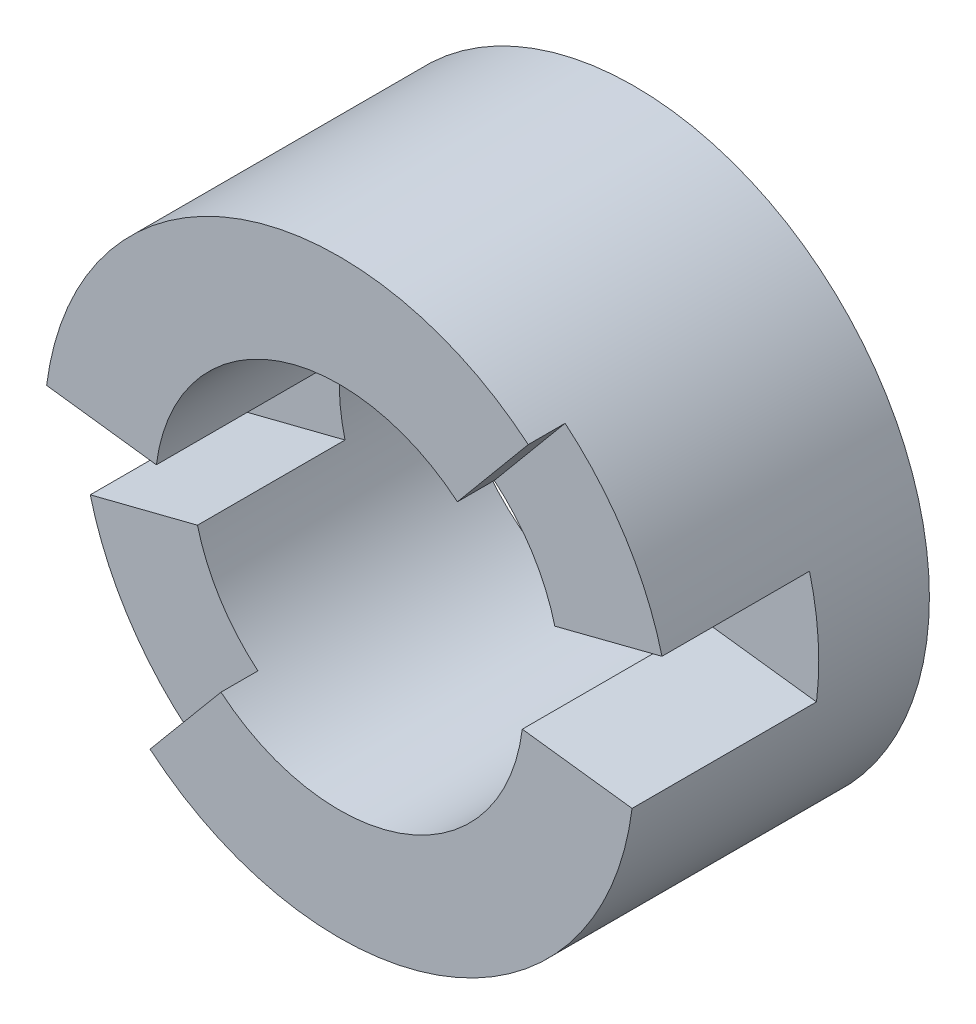
ISO-10303-21;
HEADER;
FILE_DESCRIPTION(('STEP AP214'),'2;1');
FILE_NAME('part.step','',(''),(''),'','','');
FILE_SCHEMA(('AUTOMOTIVE_DESIGN { 1 0 10303 214 1 1 1 1 }'));
ENDSEC;
DATA;
#1=APPLICATION_CONTEXT('core data for automotive mechanical design processes');
#2=APPLICATION_PROTOCOL_DEFINITION('international standard','automotive_design',2000,#1);
#3=PRODUCT_CONTEXT('',#1,'mechanical');
#4=PRODUCT('Part','Part','',(#3));
#5=PRODUCT_RELATED_PRODUCT_CATEGORY('part','',(#4));
#6=PRODUCT_DEFINITION_FORMATION('','',#4);
#7=PRODUCT_DEFINITION_CONTEXT('part definition',#1,'design');
#8=PRODUCT_DEFINITION('design','',#6,#7);
#9=PRODUCT_DEFINITION_SHAPE('','',#8);
#10=(LENGTH_UNIT() NAMED_UNIT(*) SI_UNIT(.MILLI.,.METRE.));
#11=(NAMED_UNIT(*) PLANE_ANGLE_UNIT() SI_UNIT($,.RADIAN.));
#12=(NAMED_UNIT(*) SI_UNIT($,.STERADIAN.) SOLID_ANGLE_UNIT());
#13=UNCERTAINTY_MEASURE_WITH_UNIT(LENGTH_MEASURE(1.E-05),#10,'distance_accuracy_value','');
#14=(GEOMETRIC_REPRESENTATION_CONTEXT(3) GLOBAL_UNCERTAINTY_ASSIGNED_CONTEXT((#13)) GLOBAL_UNIT_ASSIGNED_CONTEXT((#10,
#11,#12)) REPRESENTATION_CONTEXT('',''));
#15=CARTESIAN_POINT('',(0.,0.,0.));
#16=DIRECTION('',(0.,0.,1.));
#17=DIRECTION('',(1.,0.,0.));
#18=AXIS2_PLACEMENT_3D('',#15,#16,#17);
#19=CARTESIAN_POINT('',(0.,0.,8.));
#20=DIRECTION('',(0.,0.,1.));
#21=DIRECTION('',(1.,0.,0.));
#22=AXIS2_PLACEMENT_3D('',#19,#20,#21);
#23=PLANE('',#22);
#24=DIRECTION('',(-0.992098070814687,0.12546480735958,0.));
#25=VECTOR('',#24,1.);
#26=CARTESIAN_POINT('',(-7.93678456651749,1.00371845887664,8.));
#27=LINE('',#26,#25);
#28=CARTESIAN_POINT('',(-4.96049035407344,0.6273240367979,8.));
#29=VERTEX_POINT('',#28);
#30=CARTESIAN_POINT('',(-7.93678456651749,1.00371845887664,8.));
#31=VERTEX_POINT('',#30);
#32=EDGE_CURVE('E175',#29,#31,#27,.T.);
#33=ORIENTED_EDGE('',*,*,#32,.F.);
#34=CARTESIAN_POINT('',(0.,0.,8.));
#35=DIRECTION('',(0.,0.,1.));
#36=DIRECTION('',(1.,0.,0.));
#37=AXIS2_PLACEMENT_3D('',#34,#35,#36);
#38=CIRCLE('',#37,5.);
#39=CARTESIAN_POINT('',(3.20192719765573,3.84026850896035,8.));
#40=VERTEX_POINT('',#39);
#41=EDGE_CURVE('E211',#40,#29,#38,.T.);
#42=ORIENTED_EDGE('',*,*,#41,.F.);
#43=DIRECTION('',(0.640385439531147,0.768053701792069,0.));
#44=VECTOR('',#43,1.);
#45=CARTESIAN_POINT('',(5.12308351624917,6.14442961433655,8.));
#46=LINE('',#45,#44);
#47=CARTESIAN_POINT('',(5.12308351624917,6.14442961433655,8.));
#48=VERTEX_POINT('',#47);
#49=EDGE_CURVE('E110',#40,#48,#46,.T.);
#50=ORIENTED_EDGE('',*,*,#49,.T.);
#51=CARTESIAN_POINT('',(0.,0.,8.));
#52=DIRECTION('',(0.,0.,1.));
#53=DIRECTION('',(1.,0.,0.));
#54=AXIS2_PLACEMENT_3D('',#51,#52,#53);
#55=CIRCLE('',#54,8.);
#56=EDGE_CURVE('E193',#48,#31,#55,.T.);
#57=ORIENTED_EDGE('',*,*,#56,.T.);
#58=EDGE_LOOP('',(#33,#42,#50,#57));
#59=FACE_BOUND('',#58,.T.);
#60=ADVANCED_FACE('F87',(#59),#23,.T.);
#61=DIRECTION('',(-0.641607870316109,-0.767032815952765,0.));
#62=VECTOR('',#61,1.);
#63=CARTESIAN_POINT('',(-5.13286296252887,-6.13626252762211,8.));
#64=LINE('',#63,#62);
#65=CARTESIAN_POINT('',(-3.20803935158054,-3.83516407976382,8.));
#66=VERTEX_POINT('',#65);
#67=CARTESIAN_POINT('',(-5.13286296252887,-6.13626252762211,8.));
#68=VERTEX_POINT('',#67);
#69=EDGE_CURVE('E102',#66,#68,#64,.T.);
#70=ORIENTED_EDGE('',*,*,#69,.T.);
#71=CARTESIAN_POINT('',(7.93837307564306,-0.991076642800792,8.));
#72=VERTEX_POINT('',#71);
#73=EDGE_CURVE('E201',#68,#72,#55,.T.);
#74=ORIENTED_EDGE('',*,*,#73,.T.);
#75=DIRECTION('',(0.992296634455383,-0.123884580350099,0.));
#76=VECTOR('',#75,1.);
#77=CARTESIAN_POINT('',(7.93837307564306,-0.991076642800792,8.));
#78=LINE('',#77,#76);
#79=CARTESIAN_POINT('',(4.96148317227692,-0.619422901750495,8.));
#80=VERTEX_POINT('',#79);
#81=EDGE_CURVE('E242',#80,#72,#78,.T.);
#82=ORIENTED_EDGE('',*,*,#81,.F.);
#83=EDGE_CURVE('E237',#66,#80,#38,.T.);
#84=ORIENTED_EDGE('',*,*,#83,.F.);
#85=EDGE_LOOP('',(#70,#74,#82,#84));
#86=FACE_BOUND('',#85,.T.);
#87=ADVANCED_FACE('F320',(#86),#23,.T.);
#88=CARTESIAN_POINT('',(0.,0.,0.));
#89=DIRECTION('',(0.,0.,1.));
#90=DIRECTION('',(1.,0.,0.));
#91=AXIS2_PLACEMENT_3D('',#88,#89,#90);
#92=PLANE('',#91);
#93=CARTESIAN_POINT('',(0.,0.,0.));
#94=DIRECTION('',(0.,0.,1.));
#95=DIRECTION('',(1.,0.,0.));
#96=AXIS2_PLACEMENT_3D('',#93,#94,#95);
#97=CIRCLE('',#96,8.);
#98=CARTESIAN_POINT('',(8.,0.,0.));
#99=VERTEX_POINT('',#98);
#100=EDGE_CURVE('E205',#99,#99,#97,.T.);
#101=ORIENTED_EDGE('',*,*,#100,.F.);
#102=EDGE_LOOP('',(#101));
#103=FACE_BOUND('',#102,.T.);
#104=CARTESIAN_POINT('',(0.,0.,0.));
#105=DIRECTION('',(0.,0.,1.));
#106=DIRECTION('',(1.,0.,0.));
#107=AXIS2_PLACEMENT_3D('',#104,#105,#106);
#108=CIRCLE('',#107,5.);
#109=CARTESIAN_POINT('',(5.,0.,0.));
#110=VERTEX_POINT('',#109);
#111=EDGE_CURVE('E208',#110,#110,#108,.T.);
#112=ORIENTED_EDGE('',*,*,#111,.T.);
#113=EDGE_LOOP('',(#112));
#114=FACE_BOUND('',#113,.T.);
#115=ADVANCED_FACE('F353',(#103,#114),#92,.F.);
#116=CARTESIAN_POINT('',(0.,0.,8.));
#117=DIRECTION('',(0.,0.,-1.));
#118=DIRECTION('',(-1.,0.,0.));
#119=AXIS2_PLACEMENT_3D('',#116,#117,#118);
#120=CYLINDRICAL_SURFACE('',#119,8.);
#121=CARTESIAN_POINT('',(0.,0.,3.));
#122=DIRECTION('',(0.,0.,-1.));
#123=DIRECTION('',(-0.992098070814687,0.12546480735958,0.));
#124=AXIS2_PLACEMENT_3D('',#121,#122,#123);
#125=CIRCLE('',#124,8.);
#126=CARTESIAN_POINT('',(-7.75287303104365,-1.97305847975067,3.));
#127=VERTEX_POINT('',#126);
#128=CARTESIAN_POINT('',(-7.93678456651749,1.00371845887664,3.));
#129=VERTEX_POINT('',#128);
#130=EDGE_CURVE('E196',#127,#129,#125,.T.);
#131=ORIENTED_EDGE('',*,*,#130,.T.);
#132=DIRECTION('',(0.,0.,-1.));
#133=VECTOR('',#132,1.);
#134=CARTESIAN_POINT('',(-7.93678456651749,1.00371845887664,8.));
#135=LINE('',#134,#133);
#136=EDGE_CURVE('E179',#31,#129,#135,.T.);
#137=ORIENTED_EDGE('',*,*,#136,.F.);
#138=ORIENTED_EDGE('',*,*,#56,.F.);
#139=DIRECTION('',(0.,0.,1.));
#140=VECTOR('',#139,1.);
#141=CARTESIAN_POINT('',(5.12308351624918,6.14442961433655,7.));
#142=LINE('',#141,#140);
#143=CARTESIAN_POINT('',(5.12308351624917,6.14442961433655,7.));
#144=VERTEX_POINT('',#143);
#145=EDGE_CURVE('E186',#144,#48,#142,.T.);
#146=ORIENTED_EDGE('',*,*,#145,.F.);
#147=CARTESIAN_POINT('',(0.,0.,7.));
#148=DIRECTION('',(0.,0.,-1.));
#149=DIRECTION('',(0.968715100118265,0.248175451652373,0.));
#150=AXIS2_PLACEMENT_3D('',#147,#148,#149);
#151=CIRCLE('',#150,8.);
#152=CARTESIAN_POINT('',(7.74972080094612,1.98540361321898,7.));
#153=VERTEX_POINT('',#152);
#154=EDGE_CURVE('E241',#144,#153,#151,.T.);
#155=ORIENTED_EDGE('',*,*,#154,.T.);
#156=DIRECTION('',(0.,0.,1.));
#157=VECTOR('',#156,1.);
#158=CARTESIAN_POINT('',(7.74972080094612,1.98540361321898,3.));
#159=LINE('',#158,#157);
#160=CARTESIAN_POINT('',(7.74972080094612,1.98540361321899,3.));
#161=VERTEX_POINT('',#160);
#162=EDGE_CURVE('E258',#161,#153,#159,.T.);
#163=ORIENTED_EDGE('',*,*,#162,.F.);
#164=CARTESIAN_POINT('',(0.,0.,3.));
#165=DIRECTION('',(0.,0.,-1.));
#166=DIRECTION('',(0.992296634455383,-0.123884580350098,0.));
#167=AXIS2_PLACEMENT_3D('',#164,#165,#166);
#168=CIRCLE('',#167,8.);
#169=CARTESIAN_POINT('',(7.93837307564306,-0.991076642800787,3.));
#170=VERTEX_POINT('',#169);
#171=EDGE_CURVE('E262',#161,#170,#168,.T.);
#172=ORIENTED_EDGE('',*,*,#171,.T.);
#173=DIRECTION('',(0.,0.,-1.));
#174=VECTOR('',#173,1.);
#175=CARTESIAN_POINT('',(7.93837307564306,-0.991076642800787,7.99999999999999));
#176=LINE('',#175,#174);
#177=EDGE_CURVE('E254',#72,#170,#176,.T.);
#178=ORIENTED_EDGE('',*,*,#177,.F.);
#179=ORIENTED_EDGE('',*,*,#73,.F.);
#180=DIRECTION('',(0.,0.,1.));
#181=VECTOR('',#180,1.);
#182=CARTESIAN_POINT('',(-5.13286296252886,-6.13626252762212,7.00000000000003));
#183=LINE('',#182,#181);
#184=CARTESIAN_POINT('',(-5.13286296252886,-6.13626252762212,7.00000000000001));
#185=VERTEX_POINT('',#184);
#186=EDGE_CURVE('E198',#185,#68,#183,.T.);
#187=ORIENTED_EDGE('',*,*,#186,.F.);
#188=CARTESIAN_POINT('',(0.,0.,7.00000000000001));
#189=DIRECTION('',(0.,0.,-1.));
#190=DIRECTION('',(-0.969109128880456,-0.246632309968834,0.));
#191=AXIS2_PLACEMENT_3D('',#188,#189,#190);
#192=CIRCLE('',#191,8.);
#193=CARTESIAN_POINT('',(-7.75287303104365,-1.97305847975067,7.00000000000001));
#194=VERTEX_POINT('',#193);
#195=EDGE_CURVE('E270',#185,#194,#192,.T.);
#196=ORIENTED_EDGE('',*,*,#195,.T.);
#197=DIRECTION('',(0.,0.,1.));
#198=VECTOR('',#197,1.);
#199=CARTESIAN_POINT('',(-7.75287303104365,-1.97305847975067,3.));
#200=LINE('',#199,#198);
#201=EDGE_CURVE('E281',#127,#194,#200,.T.);
#202=ORIENTED_EDGE('',*,*,#201,.F.);
#203=EDGE_LOOP('',(#131,#137,#138,#146,#155,#163,#172,#178,#179,#187,#196,#202));
#204=FACE_BOUND('',#203,.T.);
#205=ORIENTED_EDGE('',*,*,#100,.T.);
#206=EDGE_LOOP('',(#205));
#207=FACE_BOUND('',#206,.T.);
#208=ADVANCED_FACE('F89',(#204,#207),#120,.T.);
#209=CARTESIAN_POINT('',(0.,0.,8.));
#210=DIRECTION('',(0.,0.,-1.));
#211=DIRECTION('',(-1.,0.,0.));
#212=AXIS2_PLACEMENT_3D('',#209,#210,#211);
#213=CYLINDRICAL_SURFACE('',#212,5.);
#214=DIRECTION('',(0.,0.,-1.));
#215=VECTOR('',#214,1.);
#216=CARTESIAN_POINT('',(-4.96049035407344,0.627324036797901,8.));
#217=LINE('',#216,#215);
#218=CARTESIAN_POINT('',(-4.96049035407344,0.627324036797901,3.));
#219=VERTEX_POINT('',#218);
#220=EDGE_CURVE('E13',#219,#29,#217,.F.);
#221=ORIENTED_EDGE('',*,*,#220,.F.);
#222=CARTESIAN_POINT('',(0.,0.,3.));
#223=DIRECTION('',(0.,0.,1.));
#224=DIRECTION('',(1.,0.,0.));
#225=AXIS2_PLACEMENT_3D('',#222,#223,#224);
#226=CIRCLE('',#225,5.);
#227=CARTESIAN_POINT('',(-4.84554564440228,-1.23316154984417,3.));
#228=VERTEX_POINT('',#227);
#229=EDGE_CURVE('E95',#228,#219,#226,.F.);
#230=ORIENTED_EDGE('',*,*,#229,.F.);
#231=DIRECTION('',(0.,0.,-1.));
#232=VECTOR('',#231,1.);
#233=CARTESIAN_POINT('',(-4.84554564440228,-1.23316154984417,8.));
#234=LINE('',#233,#232);
#235=CARTESIAN_POINT('',(-4.84554564440228,-1.23316154984417,7.00000000000001));
#236=VERTEX_POINT('',#235);
#237=EDGE_CURVE('E225',#236,#228,#234,.T.);
#238=ORIENTED_EDGE('',*,*,#237,.F.);
#239=CARTESIAN_POINT('',(0.,0.,7.00000000000001));
#240=DIRECTION('',(0.,0.,1.));
#241=DIRECTION('',(1.,0.,0.));
#242=AXIS2_PLACEMENT_3D('',#239,#240,#241);
#243=CIRCLE('',#242,5.);
#244=CARTESIAN_POINT('',(-3.20803935158054,-3.83516407976383,7.00000000000001));
#245=VERTEX_POINT('',#244);
#246=EDGE_CURVE('E223',#245,#236,#243,.F.);
#247=ORIENTED_EDGE('',*,*,#246,.F.);
#248=DIRECTION('',(0.,0.,-1.));
#249=VECTOR('',#248,1.);
#250=CARTESIAN_POINT('',(-3.20803935158054,-3.83516407976382,8.));
#251=LINE('',#250,#249);
#252=EDGE_CURVE('E221',#66,#245,#251,.T.);
#253=ORIENTED_EDGE('',*,*,#252,.F.);
#254=ORIENTED_EDGE('',*,*,#83,.T.);
#255=DIRECTION('',(0.,0.,-1.));
#256=VECTOR('',#255,1.);
#257=CARTESIAN_POINT('',(4.96148317227692,-0.619422901750492,8.));
#258=LINE('',#257,#256);
#259=CARTESIAN_POINT('',(4.96148317227692,-0.619422901750492,3.));
#260=VERTEX_POINT('',#259);
#261=EDGE_CURVE('E218',#260,#80,#258,.F.);
#262=ORIENTED_EDGE('',*,*,#261,.F.);
#263=CARTESIAN_POINT('',(0.,0.,3.));
#264=DIRECTION('',(0.,0.,1.));
#265=DIRECTION('',(1.,0.,0.));
#266=AXIS2_PLACEMENT_3D('',#263,#264,#265);
#267=CIRCLE('',#266,5.);
#268=CARTESIAN_POINT('',(4.84357550059133,1.24087725826187,3.));
#269=VERTEX_POINT('',#268);
#270=EDGE_CURVE('E216',#269,#260,#267,.F.);
#271=ORIENTED_EDGE('',*,*,#270,.F.);
#272=DIRECTION('',(0.,0.,-1.));
#273=VECTOR('',#272,1.);
#274=CARTESIAN_POINT('',(4.84357550059133,1.24087725826187,8.));
#275=LINE('',#274,#273);
#276=CARTESIAN_POINT('',(4.84357550059133,1.24087725826187,7.));
#277=VERTEX_POINT('',#276);
#278=EDGE_CURVE('E214',#277,#269,#275,.T.);
#279=ORIENTED_EDGE('',*,*,#278,.F.);
#280=CARTESIAN_POINT('',(0.,0.,7.));
#281=DIRECTION('',(0.,0.,1.));
#282=DIRECTION('',(1.,0.,0.));
#283=AXIS2_PLACEMENT_3D('',#280,#281,#282);
#284=CIRCLE('',#283,5.);
#285=CARTESIAN_POINT('',(3.20192719765573,3.84026850896034,7.));
#286=VERTEX_POINT('',#285);
#287=EDGE_CURVE('E203',#286,#277,#284,.F.);
#288=ORIENTED_EDGE('',*,*,#287,.F.);
#289=DIRECTION('',(0.,0.,-1.));
#290=VECTOR('',#289,1.);
#291=CARTESIAN_POINT('',(3.20192719765574,3.84026850896034,8.));
#292=LINE('',#291,#290);
#293=EDGE_CURVE('E200',#40,#286,#292,.T.);
#294=ORIENTED_EDGE('',*,*,#293,.F.);
#295=ORIENTED_EDGE('',*,*,#41,.T.);
#296=EDGE_LOOP('',(#221,#230,#238,#247,#253,#254,#262,#271,#279,#288,#294,#295));
#297=FACE_BOUND('',#296,.T.);
#298=ORIENTED_EDGE('',*,*,#111,.F.);
#299=EDGE_LOOP('',(#298));
#300=FACE_BOUND('',#299,.T.);
#301=ADVANCED_FACE('F234',(#297,#300),#213,.F.);
#302=CARTESIAN_POINT('',(7.93837307564306,-0.991076642800787,5.5));
#303=DIRECTION('',(-0.123884580350098,-0.992296634455383,0.));
#304=DIRECTION('',(0.,0.,-1.));
#305=AXIS2_PLACEMENT_3D('',#302,#303,#304);
#306=PLANE('',#305);
#307=ORIENTED_EDGE('',*,*,#261,.T.);
#308=ORIENTED_EDGE('',*,*,#81,.T.);
#309=ORIENTED_EDGE('',*,*,#177,.T.);
#310=DIRECTION('',(0.992296634455383,-0.123884580350098,0.));
#311=VECTOR('',#310,1.);
#312=CARTESIAN_POINT('',(7.93837307564306,-0.991076642800787,3.));
#313=LINE('',#312,#311);
#314=EDGE_CURVE('E245',#260,#170,#313,.T.);
#315=ORIENTED_EDGE('',*,*,#314,.F.);
#316=EDGE_LOOP('',(#307,#308,#309,#315));
#317=FACE_BOUND('',#316,.T.);
#318=ADVANCED_FACE('F323',(#317),#306,.F.);
#319=CARTESIAN_POINT('',(0.,0.,3.));
#320=DIRECTION('',(0.,0.,1.));
#321=DIRECTION('',(1.,0.,0.));
#322=AXIS2_PLACEMENT_3D('',#319,#320,#321);
#323=PLANE('',#322);
#324=ORIENTED_EDGE('',*,*,#270,.T.);
#325=ORIENTED_EDGE('',*,*,#314,.T.);
#326=ORIENTED_EDGE('',*,*,#171,.F.);
#327=DIRECTION('',(0.968715100118265,0.248175451652373,0.));
#328=VECTOR('',#327,1.);
#329=CARTESIAN_POINT('',(7.74972080094612,1.98540361321899,3.));
#330=LINE('',#329,#328);
#331=EDGE_CURVE('E247',#269,#161,#330,.T.);
#332=ORIENTED_EDGE('',*,*,#331,.F.);
#333=EDGE_LOOP('',(#324,#325,#326,#332));
#334=FACE_BOUND('',#333,.T.);
#335=ADVANCED_FACE('F329',(#334),#323,.T.);
#336=CARTESIAN_POINT('',(7.74972080094612,1.98540361321898,5.));
#337=DIRECTION('',(-0.248175451652373,0.968715100118265,0.));
#338=DIRECTION('',(0.,0.,1.));
#339=AXIS2_PLACEMENT_3D('',#336,#337,#338);
#340=PLANE('',#339);
#341=ORIENTED_EDGE('',*,*,#278,.T.);
#342=ORIENTED_EDGE('',*,*,#331,.T.);
#343=ORIENTED_EDGE('',*,*,#162,.T.);
#344=DIRECTION('',(0.968715100118265,0.248175451652373,0.));
#345=VECTOR('',#344,1.);
#346=CARTESIAN_POINT('',(7.74972080094612,1.98540361321898,7.));
#347=LINE('',#346,#345);
#348=EDGE_CURVE('E249',#277,#153,#347,.T.);
#349=ORIENTED_EDGE('',*,*,#348,.F.);
#350=EDGE_LOOP('',(#341,#342,#343,#349));
#351=FACE_BOUND('',#350,.T.);
#352=ADVANCED_FACE('F334',(#351),#340,.F.);
#353=CARTESIAN_POINT('',(0.,0.,7.));
#354=DIRECTION('',(0.,0.,1.));
#355=DIRECTION('',(1.,0.,0.));
#356=AXIS2_PLACEMENT_3D('',#353,#354,#355);
#357=PLANE('',#356);
#358=ORIENTED_EDGE('',*,*,#287,.T.);
#359=ORIENTED_EDGE('',*,*,#348,.T.);
#360=ORIENTED_EDGE('',*,*,#154,.F.);
#361=DIRECTION('',(0.640385439531147,0.768053701792069,0.));
#362=VECTOR('',#361,1.);
#363=CARTESIAN_POINT('',(5.12308351624917,6.14442961433655,7.));
#364=LINE('',#363,#362);
#365=EDGE_CURVE('E240',#286,#144,#364,.T.);
#366=ORIENTED_EDGE('',*,*,#365,.F.);
#367=EDGE_LOOP('',(#358,#359,#360,#366));
#368=FACE_BOUND('',#367,.T.);
#369=ADVANCED_FACE('F337',(#368),#357,.T.);
#370=CARTESIAN_POINT('',(5.12308351624918,6.14442961433655,7.5));
#371=DIRECTION('',(-0.768053701792069,0.640385439531147,0.));
#372=DIRECTION('',(0.,0.,1.));
#373=AXIS2_PLACEMENT_3D('',#370,#371,#372);
#374=PLANE('',#373);
#375=ORIENTED_EDGE('',*,*,#293,.T.);
#376=ORIENTED_EDGE('',*,*,#365,.T.);
#377=ORIENTED_EDGE('',*,*,#145,.T.);
#378=ORIENTED_EDGE('',*,*,#49,.F.);
#379=EDGE_LOOP('',(#375,#376,#377,#378));
#380=FACE_BOUND('',#379,.T.);
#381=ADVANCED_FACE('F339',(#380),#374,.F.);
#382=CARTESIAN_POINT('',(-7.93678456651749,1.00371845887664,5.5));
#383=DIRECTION('',(0.12546480735958,0.992098070814687,0.));
#384=DIRECTION('',(0.,0.,-1.));
#385=AXIS2_PLACEMENT_3D('',#382,#383,#384);
#386=PLANE('',#385);
#387=ORIENTED_EDGE('',*,*,#220,.T.);
#388=ORIENTED_EDGE('',*,*,#32,.T.);
#389=ORIENTED_EDGE('',*,*,#136,.T.);
#390=DIRECTION('',(-0.992098070814687,0.12546480735958,0.));
#391=VECTOR('',#390,1.);
#392=CARTESIAN_POINT('',(-7.93678456651749,1.00371845887664,3.));
#393=LINE('',#392,#391);
#394=EDGE_CURVE('E187',#219,#129,#393,.T.);
#395=ORIENTED_EDGE('',*,*,#394,.F.);
#396=EDGE_LOOP('',(#387,#388,#389,#395));
#397=FACE_BOUND('',#396,.T.);
#398=ADVANCED_FACE('F177',(#397),#386,.F.);
#399=CARTESIAN_POINT('',(0.,0.,3.));
#400=DIRECTION('',(0.,0.,1.));
#401=DIRECTION('',(1.,0.,0.));
#402=AXIS2_PLACEMENT_3D('',#399,#400,#401);
#403=PLANE('',#402);
#404=ORIENTED_EDGE('',*,*,#229,.T.);
#405=ORIENTED_EDGE('',*,*,#394,.T.);
#406=ORIENTED_EDGE('',*,*,#130,.F.);
#407=DIRECTION('',(-0.969109128880456,-0.246632309968834,0.));
#408=VECTOR('',#407,1.);
#409=CARTESIAN_POINT('',(-7.75287303104365,-1.97305847975067,3.));
#410=LINE('',#409,#408);
#411=EDGE_CURVE('E230',#228,#127,#410,.T.);
#412=ORIENTED_EDGE('',*,*,#411,.F.);
#413=EDGE_LOOP('',(#404,#405,#406,#412));
#414=FACE_BOUND('',#413,.T.);
#415=ADVANCED_FACE('F229',(#414),#403,.T.);
#416=CARTESIAN_POINT('',(-7.75287303104365,-1.97305847975067,5.00000000000001));
#417=DIRECTION('',(0.246632309968834,-0.969109128880456,0.));
#418=DIRECTION('',(0.,0.,1.));
#419=AXIS2_PLACEMENT_3D('',#416,#417,#418);
#420=PLANE('',#419);
#421=ORIENTED_EDGE('',*,*,#237,.T.);
#422=ORIENTED_EDGE('',*,*,#411,.T.);
#423=ORIENTED_EDGE('',*,*,#201,.T.);
#424=DIRECTION('',(-0.969109128880456,-0.246632309968834,0.));
#425=VECTOR('',#424,1.);
#426=CARTESIAN_POINT('',(-7.75287303104365,-1.97305847975067,7.00000000000001));
#427=LINE('',#426,#425);
#428=EDGE_CURVE('E273',#236,#194,#427,.T.);
#429=ORIENTED_EDGE('',*,*,#428,.F.);
#430=EDGE_LOOP('',(#421,#422,#423,#429));
#431=FACE_BOUND('',#430,.T.);
#432=ADVANCED_FACE('F308',(#431),#420,.F.);
#433=CARTESIAN_POINT('',(0.,0.,7.00000000000001));
#434=DIRECTION('',(0.,0.,1.));
#435=DIRECTION('',(1.,0.,0.));
#436=AXIS2_PLACEMENT_3D('',#433,#434,#435);
#437=PLANE('',#436);
#438=ORIENTED_EDGE('',*,*,#246,.T.);
#439=ORIENTED_EDGE('',*,*,#428,.T.);
#440=ORIENTED_EDGE('',*,*,#195,.F.);
#441=DIRECTION('',(-0.641607870316108,-0.767032815952765,0.));
#442=VECTOR('',#441,1.);
#443=CARTESIAN_POINT('',(-5.13286296252886,-6.13626252762212,7.00000000000001));
#444=LINE('',#443,#442);
#445=EDGE_CURVE('E269',#245,#185,#444,.T.);
#446=ORIENTED_EDGE('',*,*,#445,.F.);
#447=EDGE_LOOP('',(#438,#439,#440,#446));
#448=FACE_BOUND('',#447,.T.);
#449=ADVANCED_FACE('F314',(#448),#437,.T.);
#450=CARTESIAN_POINT('',(-5.13286296252887,-6.13626252762212,7.50000000000001));
#451=DIRECTION('',(0.767032815952765,-0.641607870316108,0.));
#452=DIRECTION('',(0.,0.,1.));
#453=AXIS2_PLACEMENT_3D('',#450,#451,#452);
#454=PLANE('',#453);
#455=ORIENTED_EDGE('',*,*,#252,.T.);
#456=ORIENTED_EDGE('',*,*,#445,.T.);
#457=ORIENTED_EDGE('',*,*,#186,.T.);
#458=ORIENTED_EDGE('',*,*,#69,.F.);
#459=EDGE_LOOP('',(#455,#456,#457,#458));
#460=FACE_BOUND('',#459,.T.);
#461=ADVANCED_FACE('F418',(#460),#454,.F.);
#462=CLOSED_SHELL('',(#60,#87,#115,#208,#301,#318,#335,#352,#369,#381,#398,#415,#432,#449,#461));
#463=MANIFOLD_SOLID_BREP('B2',#462);
#464=ADVANCED_BREP_SHAPE_REPRESENTATION('',(#18,#463),#14);
#465=SHAPE_DEFINITION_REPRESENTATION(#9,#464);
ENDSEC;
END-ISO-10303-21;
